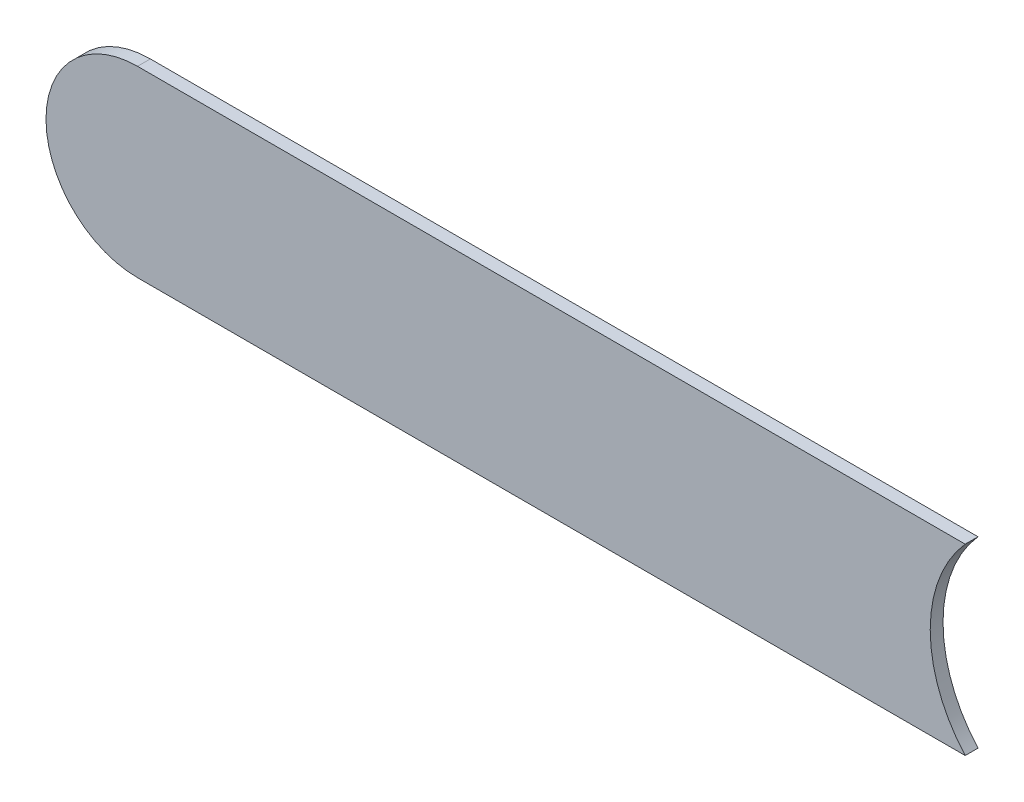
ISO-10303-21;
HEADER;
FILE_DESCRIPTION(('STEP AP214'),'2;1');
FILE_NAME('part.step','',(''),(''),'','','');
FILE_SCHEMA(('AUTOMOTIVE_DESIGN { 1 0 10303 214 1 1 1 1 }'));
ENDSEC;
DATA;
#1=APPLICATION_CONTEXT('core data for automotive mechanical design processes');
#2=APPLICATION_PROTOCOL_DEFINITION('international standard','automotive_design',2000,#1);
#3=PRODUCT_CONTEXT('',#1,'mechanical');
#4=PRODUCT('Part','Part','',(#3));
#5=PRODUCT_RELATED_PRODUCT_CATEGORY('part','',(#4));
#6=PRODUCT_DEFINITION_FORMATION('','',#4);
#7=PRODUCT_DEFINITION_CONTEXT('part definition',#1,'design');
#8=PRODUCT_DEFINITION('design','',#6,#7);
#9=PRODUCT_DEFINITION_SHAPE('','',#8);
#10=(LENGTH_UNIT() NAMED_UNIT(*) SI_UNIT(.MILLI.,.METRE.));
#11=(NAMED_UNIT(*) PLANE_ANGLE_UNIT() SI_UNIT($,.RADIAN.));
#12=(NAMED_UNIT(*) SI_UNIT($,.STERADIAN.) SOLID_ANGLE_UNIT());
#13=UNCERTAINTY_MEASURE_WITH_UNIT(LENGTH_MEASURE(1.E-05),#10,'distance_accuracy_value','');
#14=(GEOMETRIC_REPRESENTATION_CONTEXT(3) GLOBAL_UNCERTAINTY_ASSIGNED_CONTEXT((#13)) GLOBAL_UNIT_ASSIGNED_CONTEXT((#10,
#11,#12)) REPRESENTATION_CONTEXT('',''));
#15=CARTESIAN_POINT('',(0.,0.,0.));
#16=DIRECTION('',(0.,0.,1.));
#17=DIRECTION('',(1.,0.,0.));
#18=AXIS2_PLACEMENT_3D('',#15,#16,#17);
#19=CARTESIAN_POINT('',(152.908,-76.45,-0.035));
#20=DIRECTION('',(0.,1.,0.));
#21=DIRECTION('',(1.,0.,0.));
#22=AXIS2_PLACEMENT_3D('',#19,#20,#21);
#23=PLANE('',#22);
#24=DIRECTION('',(0.,0.,-1.));
#25=VECTOR('',#24,1.);
#26=CARTESIAN_POINT('',(155.16849150281,-76.45,-0.045));
#27=LINE('',#26,#25);
#28=CARTESIAN_POINT('',(155.16849150281,-76.45,0.));
#29=VERTEX_POINT('',#28);
#30=CARTESIAN_POINT('',(155.16849150281,-76.45,-0.035));
#31=VERTEX_POINT('',#30);
#32=EDGE_CURVE('E11',#29,#31,#27,.T.);
#33=ORIENTED_EDGE('',*,*,#32,.F.);
#34=DIRECTION('',(1.,0.,0.));
#35=VECTOR('',#34,1.);
#36=CARTESIAN_POINT('',(152.908,-76.45,0.));
#37=LINE('',#36,#35);
#38=CARTESIAN_POINT('',(152.908,-76.45,0.));
#39=VERTEX_POINT('',#38);
#40=EDGE_CURVE('E20',#39,#29,#37,.T.);
#41=ORIENTED_EDGE('',*,*,#40,.F.);
#42=DIRECTION('',(0.,0.,1.));
#43=VECTOR('',#42,1.);
#44=CARTESIAN_POINT('',(152.908,-76.45,-0.035));
#45=LINE('',#44,#43);
#46=CARTESIAN_POINT('',(152.908,-76.45,-0.035));
#47=VERTEX_POINT('',#46);
#48=EDGE_CURVE('E65',#47,#39,#45,.T.);
#49=ORIENTED_EDGE('',*,*,#48,.F.);
#50=DIRECTION('',(1.,0.,0.));
#51=VECTOR('',#50,1.);
#52=CARTESIAN_POINT('',(152.908,-76.45,-0.035));
#53=LINE('',#52,#51);
#54=EDGE_CURVE('E68',#47,#31,#53,.T.);
#55=ORIENTED_EDGE('',*,*,#54,.T.);
#56=EDGE_LOOP('',(#33,#41,#49,#55));
#57=FACE_BOUND('',#56,.T.);
#58=ADVANCED_FACE('F17',(#57),#23,.F.);
#59=CARTESIAN_POINT('',(155.448,-76.2,-0.045));
#60=DIRECTION('',(0.,0.,-1.));
#61=DIRECTION('',(0.,-1.,0.));
#62=AXIS2_PLACEMENT_3D('',#59,#60,#61);
#63=CYLINDRICAL_SURFACE('',#62,0.375);
#64=DIRECTION('',(0.,0.,-1.));
#65=VECTOR('',#64,1.);
#66=CARTESIAN_POINT('',(155.16849150281,-75.95,-0.045));
#67=LINE('',#66,#65);
#68=CARTESIAN_POINT('',(155.1684915028,-75.95,0.));
#69=VERTEX_POINT('',#68);
#70=CARTESIAN_POINT('',(155.1684915028,-75.95,-0.035));
#71=VERTEX_POINT('',#70);
#72=EDGE_CURVE('E93',#69,#71,#67,.T.);
#73=ORIENTED_EDGE('',*,*,#72,.F.);
#74=CARTESIAN_POINT('',(155.448,-76.2,0.));
#75=DIRECTION('',(0.,0.,-1.));
#76=DIRECTION('',(0.,-1.,0.));
#77=AXIS2_PLACEMENT_3D('',#74,#75,#76);
#78=CIRCLE('',#77,0.375);
#79=EDGE_CURVE('E98',#29,#69,#78,.T.);
#80=ORIENTED_EDGE('',*,*,#79,.F.);
#81=ORIENTED_EDGE('',*,*,#32,.T.);
#82=CARTESIAN_POINT('',(155.448,-76.2,-0.035));
#83=DIRECTION('',(0.,0.,-1.));
#84=DIRECTION('',(0.,-1.,0.));
#85=AXIS2_PLACEMENT_3D('',#82,#83,#84);
#86=CIRCLE('',#85,0.375);
#87=EDGE_CURVE('E72',#31,#71,#86,.T.);
#88=ORIENTED_EDGE('',*,*,#87,.T.);
#89=EDGE_LOOP('',(#73,#80,#81,#88));
#90=FACE_BOUND('',#89,.T.);
#91=ADVANCED_FACE('F114',(#90),#63,.F.);
#92=CARTESIAN_POINT('',(155.448,-75.95,0.));
#93=DIRECTION('',(0.,0.,1.));
#94=DIRECTION('',(1.,0.,0.));
#95=AXIS2_PLACEMENT_3D('',#92,#93,#94);
#96=PLANE('',#95);
#97=ORIENTED_EDGE('',*,*,#79,.T.);
#98=DIRECTION('',(-1.,0.,0.));
#99=VECTOR('',#98,1.);
#100=CARTESIAN_POINT('',(155.448,-75.95,0.));
#101=LINE('',#100,#99);
#102=CARTESIAN_POINT('',(152.908,-75.95,0.));
#103=VERTEX_POINT('',#102);
#104=EDGE_CURVE('E119',#69,#103,#101,.T.);
#105=ORIENTED_EDGE('',*,*,#104,.T.);
#106=CARTESIAN_POINT('',(152.908,-76.2,0.));
#107=DIRECTION('',(0.,0.,1.));
#108=DIRECTION('',(0.,1.,0.));
#109=AXIS2_PLACEMENT_3D('',#106,#107,#108);
#110=CIRCLE('',#109,0.25);
#111=EDGE_CURVE('E71',#103,#39,#110,.T.);
#112=ORIENTED_EDGE('',*,*,#111,.T.);
#113=ORIENTED_EDGE('',*,*,#40,.T.);
#114=EDGE_LOOP('',(#97,#105,#112,#113));
#115=FACE_BOUND('',#114,.T.);
#116=ADVANCED_FACE('F112',(#115),#96,.T.);
#117=CARTESIAN_POINT('',(152.908,-76.2,-0.035));
#118=DIRECTION('',(0.,0.,-1.));
#119=DIRECTION('',(0.,1.,0.));
#120=AXIS2_PLACEMENT_3D('',#117,#118,#119);
#121=CYLINDRICAL_SURFACE('',#120,0.25);
#122=CARTESIAN_POINT('',(152.908,-76.2,-0.035));
#123=DIRECTION('',(0.,0.,1.));
#124=DIRECTION('',(0.,1.,0.));
#125=AXIS2_PLACEMENT_3D('',#122,#123,#124);
#126=CIRCLE('',#125,0.25);
#127=CARTESIAN_POINT('',(152.908,-75.95,-0.035));
#128=VERTEX_POINT('',#127);
#129=EDGE_CURVE('E75',#128,#47,#126,.T.);
#130=ORIENTED_EDGE('',*,*,#129,.T.);
#131=ORIENTED_EDGE('',*,*,#48,.T.);
#132=ORIENTED_EDGE('',*,*,#111,.F.);
#133=DIRECTION('',(0.,0.,1.));
#134=VECTOR('',#133,1.);
#135=CARTESIAN_POINT('',(152.908,-75.95,-0.035));
#136=LINE('',#135,#134);
#137=EDGE_CURVE('E78',#128,#103,#136,.T.);
#138=ORIENTED_EDGE('',*,*,#137,.F.);
#139=EDGE_LOOP('',(#130,#131,#132,#138));
#140=FACE_BOUND('',#139,.T.);
#141=ADVANCED_FACE('F76',(#140),#121,.T.);
#142=CARTESIAN_POINT('',(155.448,-75.95,-0.035));
#143=DIRECTION('',(0.,0.,1.));
#144=DIRECTION('',(1.,0.,0.));
#145=AXIS2_PLACEMENT_3D('',#142,#143,#144);
#146=PLANE('',#145);
#147=ORIENTED_EDGE('',*,*,#54,.F.);
#148=ORIENTED_EDGE('',*,*,#129,.F.);
#149=DIRECTION('',(-1.,0.,0.));
#150=VECTOR('',#149,1.);
#151=CARTESIAN_POINT('',(155.448,-75.95,-0.035));
#152=LINE('',#151,#150);
#153=EDGE_CURVE('E87',#71,#128,#152,.T.);
#154=ORIENTED_EDGE('',*,*,#153,.F.);
#155=ORIENTED_EDGE('',*,*,#87,.F.);
#156=EDGE_LOOP('',(#147,#148,#154,#155));
#157=FACE_BOUND('',#156,.T.);
#158=ADVANCED_FACE('F85',(#157),#146,.F.);
#159=CARTESIAN_POINT('',(155.448,-75.95,-0.035));
#160=DIRECTION('',(0.,-1.,0.));
#161=DIRECTION('',(0.,0.,-1.));
#162=AXIS2_PLACEMENT_3D('',#159,#160,#161);
#163=PLANE('',#162);
#164=ORIENTED_EDGE('',*,*,#137,.T.);
#165=ORIENTED_EDGE('',*,*,#104,.F.);
#166=ORIENTED_EDGE('',*,*,#72,.T.);
#167=ORIENTED_EDGE('',*,*,#153,.T.);
#168=EDGE_LOOP('',(#164,#165,#166,#167));
#169=FACE_BOUND('',#168,.T.);
#170=ADVANCED_FACE('F120',(#169),#163,.F.);
#171=CLOSED_SHELL('',(#58,#91,#116,#141,#158,#170));
#172=MANIFOLD_SOLID_BREP('B1',#171);
#173=ADVANCED_BREP_SHAPE_REPRESENTATION('',(#18,#172),#14);
#174=SHAPE_DEFINITION_REPRESENTATION(#9,#173);
ENDSEC;
END-ISO-10303-21;
